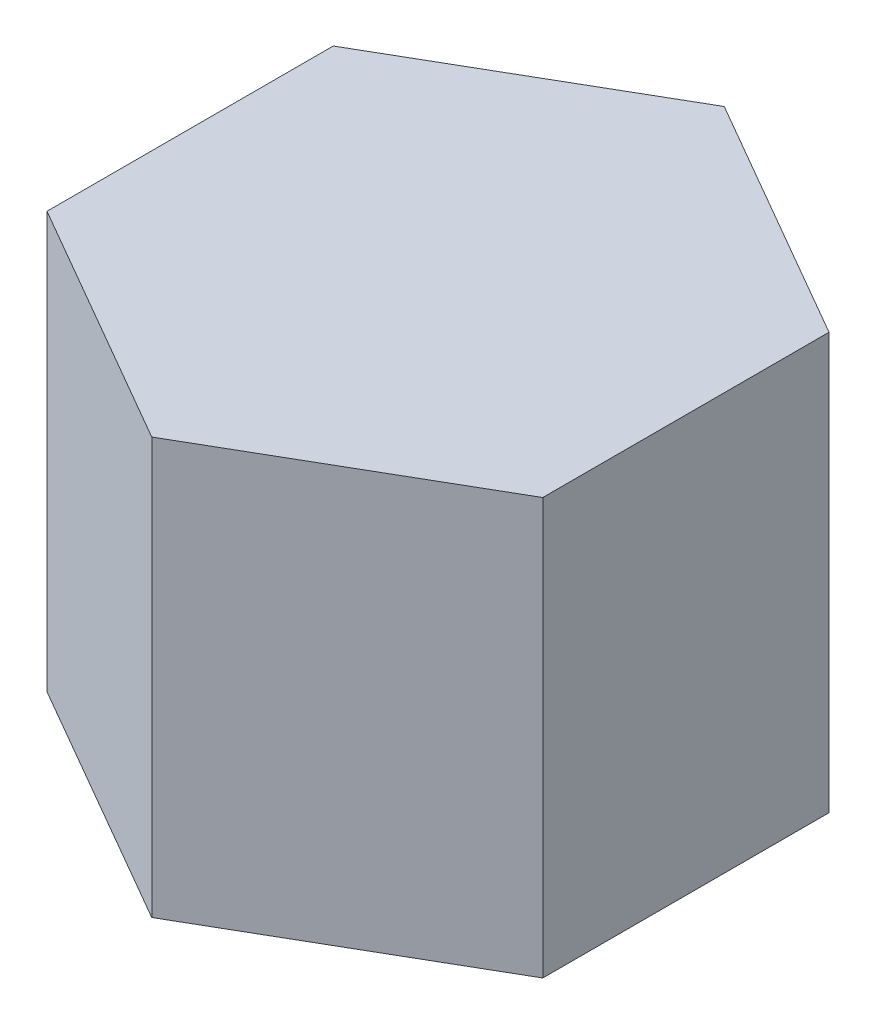
ISO-10303-21;
HEADER;
FILE_DESCRIPTION(('STEP AP214'),'2;1');
FILE_NAME('part.step','',(''),(''),'','','');
FILE_SCHEMA(('AUTOMOTIVE_DESIGN { 1 0 10303 214 1 1 1 1 }'));
ENDSEC;
DATA;
#1=APPLICATION_CONTEXT('core data for automotive mechanical design processes');
#2=APPLICATION_PROTOCOL_DEFINITION('international standard','automotive_design',2000,#1);
#3=PRODUCT_CONTEXT('',#1,'mechanical');
#4=PRODUCT('Part','Part','',(#3));
#5=PRODUCT_RELATED_PRODUCT_CATEGORY('part','',(#4));
#6=PRODUCT_DEFINITION_FORMATION('','',#4);
#7=PRODUCT_DEFINITION_CONTEXT('part definition',#1,'design');
#8=PRODUCT_DEFINITION('design','',#6,#7);
#9=PRODUCT_DEFINITION_SHAPE('','',#8);
#10=(LENGTH_UNIT() NAMED_UNIT(*) SI_UNIT(.MILLI.,.METRE.));
#11=(NAMED_UNIT(*) PLANE_ANGLE_UNIT() SI_UNIT($,.RADIAN.));
#12=(NAMED_UNIT(*) SI_UNIT($,.STERADIAN.) SOLID_ANGLE_UNIT());
#13=UNCERTAINTY_MEASURE_WITH_UNIT(LENGTH_MEASURE(1.E-05),#10,'distance_accuracy_value','');
#14=(GEOMETRIC_REPRESENTATION_CONTEXT(3) GLOBAL_UNCERTAINTY_ASSIGNED_CONTEXT((#13)) GLOBAL_UNIT_ASSIGNED_CONTEXT((#10,
#11,#12)) REPRESENTATION_CONTEXT('',''));
#15=CARTESIAN_POINT('',(0.,0.,0.));
#16=DIRECTION('',(0.,0.,1.));
#17=DIRECTION('',(1.,0.,0.));
#18=AXIS2_PLACEMENT_3D('',#15,#16,#17);
#19=CARTESIAN_POINT('',(209.839551417382,-147.556598747966,287.351844201572));
#20=DIRECTION('',(-0.499999999999978,0.,-0.866025403784452));
#21=DIRECTION('',(-0.866025403784452,0.,0.499999999999978));
#22=AXIS2_PLACEMENT_3D('',#19,#20,#21);
#23=PLANE('',#22);
#24=CARTESIAN_POINT('',(210.142660308706,-147.047793579175,287.176844201572));
#25=DIRECTION('',(-0.866025403784452,0.,0.499999999999978));
#26=VECTOR('',#25,1.);
#27=LINE('',#24,#26);
#28=CARTESIAN_POINT('',(210.142660308706,-147.047793579175,287.176844201572));
#29=VERTEX_POINT('',#28);
#30=CARTESIAN_POINT('',(209.839551417382,-147.047793579175,287.351844201572));
#31=VERTEX_POINT('',#30);
#32=EDGE_CURVE('E170',#29,#31,#27,.T.);
#33=ORIENTED_EDGE('',*,*,#32,.T.);
#34=CARTESIAN_POINT('',(209.839551417382,-147.556598747966,287.351844201572));
#35=DIRECTION('',(0.,1.,0.));
#36=VECTOR('',#35,1.);
#37=LINE('',#34,#36);
#38=CARTESIAN_POINT('',(209.839551417382,-147.556598747966,287.351844201572));
#39=VERTEX_POINT('',#38);
#40=EDGE_CURVE('E35',#39,#31,#37,.T.);
#41=ORIENTED_EDGE('',*,*,#40,.F.);
#42=CARTESIAN_POINT('',(210.142660308706,-147.556598747966,287.176844201572));
#43=DIRECTION('',(-0.866025403784452,0.,0.499999999999978));
#44=VECTOR('',#43,1.);
#45=LINE('',#42,#44);
#46=CARTESIAN_POINT('',(210.142660308706,-147.556598747966,287.176844201572));
#47=VERTEX_POINT('',#46);
#48=EDGE_CURVE('E159',#47,#39,#45,.T.);
#49=ORIENTED_EDGE('',*,*,#48,.F.);
#50=CARTESIAN_POINT('',(210.142660308706,-147.556598747966,287.176844201572));
#51=DIRECTION('',(0.,1.,0.));
#52=VECTOR('',#51,1.);
#53=LINE('',#50,#52);
#54=EDGE_CURVE('E10',#47,#29,#53,.T.);
#55=ORIENTED_EDGE('',*,*,#54,.T.);
#56=EDGE_LOOP('',(#33,#41,#49,#55));
#57=FACE_BOUND('',#56,.T.);
#58=ADVANCED_FACE('F16',(#57),#23,.F.);
#59=CARTESIAN_POINT('',(210.142660308706,-147.556598747966,291.594471220494));
#60=DIRECTION('',(-1.,0.,0.));
#61=DIRECTION('',(0.,-1.,0.));
#62=AXIS2_PLACEMENT_3D('',#59,#60,#61);
#63=PLANE('',#62);
#64=CARTESIAN_POINT('',(210.142660308706,-147.047793579175,286.826844201572));
#65=DIRECTION('',(0.,0.,1.));
#66=VECTOR('',#65,1.);
#67=LINE('',#64,#66);
#68=CARTESIAN_POINT('',(210.142660308706,-147.047793579175,286.826844201572));
#69=VERTEX_POINT('',#68);
#70=EDGE_CURVE('E167',#69,#29,#67,.T.);
#71=ORIENTED_EDGE('',*,*,#70,.T.);
#72=ORIENTED_EDGE('',*,*,#54,.F.);
#73=CARTESIAN_POINT('',(210.142660308706,-147.556598747966,286.826844201572));
#74=DIRECTION('',(0.,0.,1.));
#75=VECTOR('',#74,1.);
#76=LINE('',#73,#75);
#77=CARTESIAN_POINT('',(210.142660308706,-147.556598747966,286.826844201572));
#78=VERTEX_POINT('',#77);
#79=EDGE_CURVE('E156',#78,#47,#76,.T.);
#80=ORIENTED_EDGE('',*,*,#79,.F.);
#81=CARTESIAN_POINT('',(210.142660308706,-147.556598747966,286.826844201572));
#82=DIRECTION('',(0.,1.,0.));
#83=VECTOR('',#82,1.);
#84=LINE('',#81,#83);
#85=EDGE_CURVE('E27',#78,#69,#84,.T.);
#86=ORIENTED_EDGE('',*,*,#85,.T.);
#87=EDGE_LOOP('',(#71,#72,#80,#86));
#88=FACE_BOUND('',#87,.T.);
#89=ADVANCED_FACE('F189',(#88),#63,.F.);
#90=CARTESIAN_POINT('',(210.142660308706,-147.556598747966,286.826844201572));
#91=DIRECTION('',(-0.499999999999943,0.,0.866025403784471));
#92=DIRECTION('',(0.866025403784471,0.,0.499999999999943));
#93=AXIS2_PLACEMENT_3D('',#90,#91,#92);
#94=PLANE('',#93);
#95=CARTESIAN_POINT('',(209.839551417382,-147.047793579175,286.651844201572));
#96=DIRECTION('',(0.866025403784471,0.,0.499999999999943));
#97=VECTOR('',#96,1.);
#98=LINE('',#95,#97);
#99=CARTESIAN_POINT('',(209.839551417382,-147.047793579175,286.651844201572));
#100=VERTEX_POINT('',#99);
#101=EDGE_CURVE('E163',#100,#69,#98,.T.);
#102=ORIENTED_EDGE('',*,*,#101,.T.);
#103=ORIENTED_EDGE('',*,*,#85,.F.);
#104=CARTESIAN_POINT('',(209.839551417382,-147.556598747966,286.651844201572));
#105=DIRECTION('',(0.866025403784471,0.,0.499999999999943));
#106=VECTOR('',#105,1.);
#107=LINE('',#104,#106);
#108=CARTESIAN_POINT('',(209.839551417382,-147.556598747966,286.651844201572));
#109=VERTEX_POINT('',#108);
#110=EDGE_CURVE('E106',#109,#78,#107,.T.);
#111=ORIENTED_EDGE('',*,*,#110,.F.);
#112=CARTESIAN_POINT('',(209.839551417382,-147.556598747966,286.651844201572));
#113=DIRECTION('',(0.,1.,0.));
#114=VECTOR('',#113,1.);
#115=LINE('',#112,#114);
#116=EDGE_CURVE('E94',#109,#100,#115,.T.);
#117=ORIENTED_EDGE('',*,*,#116,.T.);
#118=EDGE_LOOP('',(#102,#103,#111,#117));
#119=FACE_BOUND('',#118,.T.);
#120=ADVANCED_FACE('F198',(#119),#94,.F.);
#121=CARTESIAN_POINT('',(209.839551417382,-147.556598747966,286.651844201572));
#122=DIRECTION('',(0.499999999999978,0.,0.866025403784452));
#123=DIRECTION('',(0.866025403784452,0.,-0.499999999999978));
#124=AXIS2_PLACEMENT_3D('',#121,#122,#123);
#125=PLANE('',#124);
#126=CARTESIAN_POINT('',(209.536442526057,-147.047793579175,286.826844201572));
#127=DIRECTION('',(0.866025403784452,0.,-0.499999999999978));
#128=VECTOR('',#127,1.);
#129=LINE('',#126,#128);
#130=CARTESIAN_POINT('',(209.536442526057,-147.047793579175,286.826844201572));
#131=VERTEX_POINT('',#130);
#132=EDGE_CURVE('E162',#131,#100,#129,.T.);
#133=ORIENTED_EDGE('',*,*,#132,.T.);
#134=ORIENTED_EDGE('',*,*,#116,.F.);
#135=CARTESIAN_POINT('',(209.536442526057,-147.556598747966,286.826844201572));
#136=DIRECTION('',(0.866025403784452,0.,-0.499999999999978));
#137=VECTOR('',#136,1.);
#138=LINE('',#135,#137);
#139=CARTESIAN_POINT('',(209.536442526057,-147.556598747966,286.826844201572));
#140=VERTEX_POINT('',#139);
#141=EDGE_CURVE('E98',#140,#109,#138,.T.);
#142=ORIENTED_EDGE('',*,*,#141,.F.);
#143=CARTESIAN_POINT('',(209.536442526057,-147.556598747966,286.826844201572));
#144=DIRECTION('',(0.,1.,0.));
#145=VECTOR('',#144,1.);
#146=LINE('',#143,#145);
#147=EDGE_CURVE('E79',#140,#131,#146,.T.);
#148=ORIENTED_EDGE('',*,*,#147,.T.);
#149=EDGE_LOOP('',(#133,#134,#142,#148));
#150=FACE_BOUND('',#149,.T.);
#151=ADVANCED_FACE('F100',(#150),#125,.F.);
#152=CARTESIAN_POINT('',(209.536442526057,-147.556598747966,291.594471220494));
#153=DIRECTION('',(1.,0.,0.));
#154=DIRECTION('',(0.,1.,0.));
#155=AXIS2_PLACEMENT_3D('',#152,#153,#154);
#156=PLANE('',#155);
#157=CARTESIAN_POINT('',(209.536442526057,-147.047793579175,287.176844201572));
#158=DIRECTION('',(0.,0.,-1.));
#159=VECTOR('',#158,1.);
#160=LINE('',#157,#159);
#161=CARTESIAN_POINT('',(209.536442526057,-147.047793579175,287.176844201572));
#162=VERTEX_POINT('',#161);
#163=EDGE_CURVE('E88',#162,#131,#160,.T.);
#164=ORIENTED_EDGE('',*,*,#163,.T.);
#165=ORIENTED_EDGE('',*,*,#147,.F.);
#166=CARTESIAN_POINT('',(209.536442526057,-147.556598747966,287.176844201572));
#167=DIRECTION('',(0.,0.,-1.));
#168=VECTOR('',#167,1.);
#169=LINE('',#166,#168);
#170=CARTESIAN_POINT('',(209.536442526057,-147.556598747966,287.176844201572));
#171=VERTEX_POINT('',#170);
#172=EDGE_CURVE('E84',#171,#140,#169,.T.);
#173=ORIENTED_EDGE('',*,*,#172,.F.);
#174=CARTESIAN_POINT('',(209.536442526057,-147.556598747966,287.176844201572));
#175=DIRECTION('',(0.,1.,0.));
#176=VECTOR('',#175,1.);
#177=LINE('',#174,#176);
#178=EDGE_CURVE('E58',#171,#162,#177,.T.);
#179=ORIENTED_EDGE('',*,*,#178,.T.);
#180=EDGE_LOOP('',(#164,#165,#173,#179));
#181=FACE_BOUND('',#180,.T.);
#182=ADVANCED_FACE('F82',(#181),#156,.F.);
#183=CARTESIAN_POINT('',(209.536442526057,-147.556598747966,287.176844201572));
#184=DIRECTION('',(0.499999999999943,0.,-0.866025403784471));
#185=DIRECTION('',(-0.866025403784471,0.,-0.499999999999943));
#186=AXIS2_PLACEMENT_3D('',#183,#184,#185);
#187=PLANE('',#186);
#188=CARTESIAN_POINT('',(209.839551417382,-147.047793579175,287.351844201572));
#189=DIRECTION('',(-0.866025403784471,0.,-0.499999999999943));
#190=VECTOR('',#189,1.);
#191=LINE('',#188,#190);
#192=EDGE_CURVE('E160',#31,#162,#191,.T.);
#193=ORIENTED_EDGE('',*,*,#192,.T.);
#194=ORIENTED_EDGE('',*,*,#178,.F.);
#195=CARTESIAN_POINT('',(209.839551417382,-147.556598747966,287.351844201572));
#196=DIRECTION('',(-0.866025403784471,0.,-0.499999999999943));
#197=VECTOR('',#196,1.);
#198=LINE('',#195,#197);
#199=EDGE_CURVE('E112',#39,#171,#198,.T.);
#200=ORIENTED_EDGE('',*,*,#199,.F.);
#201=ORIENTED_EDGE('',*,*,#40,.T.);
#202=EDGE_LOOP('',(#193,#194,#200,#201));
#203=FACE_BOUND('',#202,.T.);
#204=ADVANCED_FACE('F131',(#203),#187,.F.);
#205=CARTESIAN_POINT('',(206.491105863044,-147.556598747966,291.594471220494));
#206=DIRECTION('',(0.,1.,0.));
#207=DIRECTION('',(-1.,0.,0.));
#208=AXIS2_PLACEMENT_3D('',#205,#206,#207);
#209=PLANE('',#208);
#210=ORIENTED_EDGE('',*,*,#48,.T.);
#211=ORIENTED_EDGE('',*,*,#199,.T.);
#212=ORIENTED_EDGE('',*,*,#172,.T.);
#213=ORIENTED_EDGE('',*,*,#141,.T.);
#214=ORIENTED_EDGE('',*,*,#110,.T.);
#215=ORIENTED_EDGE('',*,*,#79,.T.);
#216=EDGE_LOOP('',(#210,#211,#212,#213,#214,#215));
#217=FACE_BOUND('',#216,.T.);
#218=ADVANCED_FACE('F111',(#217),#209,.F.);
#219=CARTESIAN_POINT('',(206.491105863044,-147.047793579175,291.594471220494));
#220=DIRECTION('',(0.,1.,0.));
#221=DIRECTION('',(-1.,0.,0.));
#222=AXIS2_PLACEMENT_3D('',#219,#220,#221);
#223=PLANE('',#222);
#224=ORIENTED_EDGE('',*,*,#32,.F.);
#225=ORIENTED_EDGE('',*,*,#70,.F.);
#226=ORIENTED_EDGE('',*,*,#101,.F.);
#227=ORIENTED_EDGE('',*,*,#132,.F.);
#228=ORIENTED_EDGE('',*,*,#163,.F.);
#229=ORIENTED_EDGE('',*,*,#192,.F.);
#230=EDGE_LOOP('',(#224,#225,#226,#227,#228,#229));
#231=FACE_BOUND('',#230,.T.);
#232=ADVANCED_FACE('F130',(#231),#223,.T.);
#233=CLOSED_SHELL('',(#58,#89,#120,#151,#182,#204,#218,#232));
#234=MANIFOLD_SOLID_BREP('B1',#233);
#235=ADVANCED_BREP_SHAPE_REPRESENTATION('',(#18,#234),#14);
#236=SHAPE_DEFINITION_REPRESENTATION(#9,#235);
ENDSEC;
END-ISO-10303-21;
